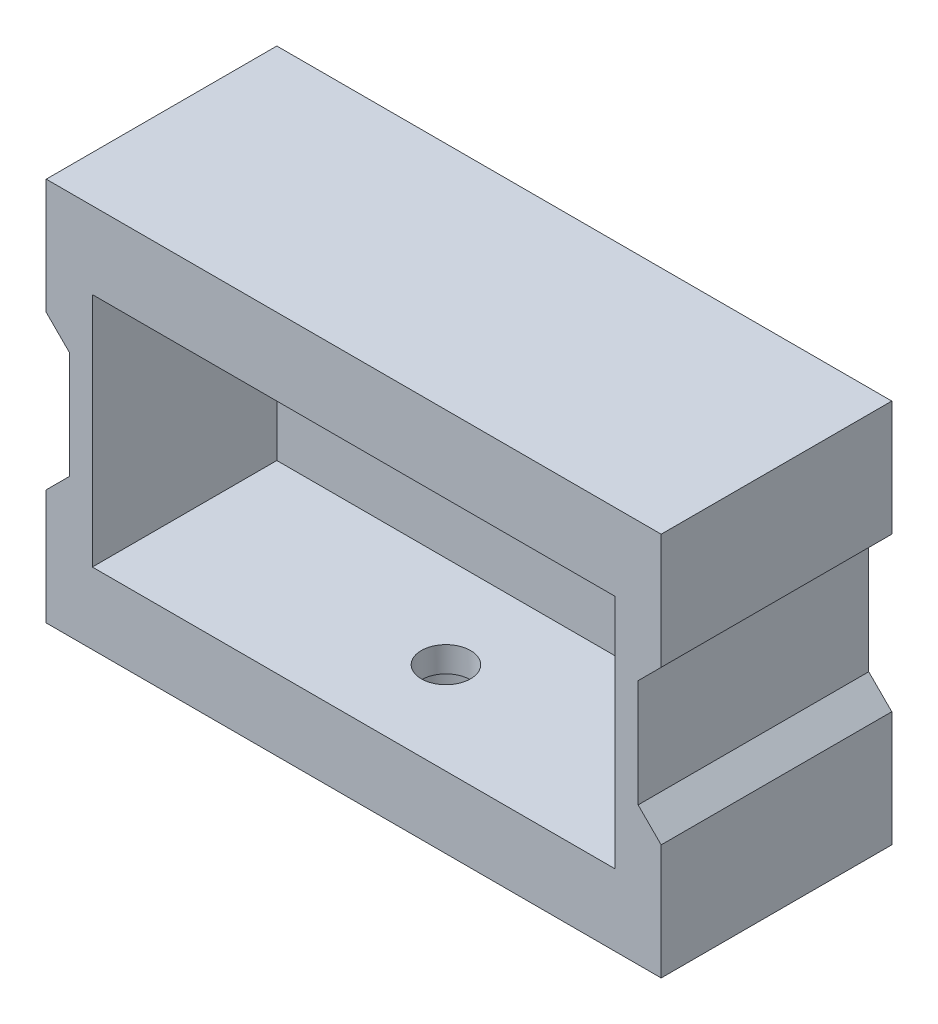
ISO-10303-21;
HEADER;
FILE_DESCRIPTION(('STEP AP214'),'2;1');
FILE_NAME('part.step','',(''),(''),'','','');
FILE_SCHEMA(('AUTOMOTIVE_DESIGN { 1 0 10303 214 1 1 1 1 }'));
ENDSEC;
DATA;
#1=APPLICATION_CONTEXT('core data for automotive mechanical design processes');
#2=APPLICATION_PROTOCOL_DEFINITION('international standard','automotive_design',2000,#1);
#3=PRODUCT_CONTEXT('',#1,'mechanical');
#4=PRODUCT('Part','Part','',(#3));
#5=PRODUCT_RELATED_PRODUCT_CATEGORY('part','',(#4));
#6=PRODUCT_DEFINITION_FORMATION('','',#4);
#7=PRODUCT_DEFINITION_CONTEXT('part definition',#1,'design');
#8=PRODUCT_DEFINITION('design','',#6,#7);
#9=PRODUCT_DEFINITION_SHAPE('','',#8);
#10=(LENGTH_UNIT() NAMED_UNIT(*) SI_UNIT(.MILLI.,.METRE.));
#11=(NAMED_UNIT(*) PLANE_ANGLE_UNIT() SI_UNIT($,.RADIAN.));
#12=(NAMED_UNIT(*) SI_UNIT($,.STERADIAN.) SOLID_ANGLE_UNIT());
#13=UNCERTAINTY_MEASURE_WITH_UNIT(LENGTH_MEASURE(1.E-05),#10,'distance_accuracy_value','');
#14=(GEOMETRIC_REPRESENTATION_CONTEXT(3) GLOBAL_UNCERTAINTY_ASSIGNED_CONTEXT((#13)) GLOBAL_UNIT_ASSIGNED_CONTEXT((#10,
#11,#12)) REPRESENTATION_CONTEXT('',''));
#15=CARTESIAN_POINT('',(0.,0.,0.));
#16=DIRECTION('',(0.,0.,1.));
#17=DIRECTION('',(1.,0.,0.));
#18=AXIS2_PLACEMENT_3D('',#15,#16,#17);
#19=CARTESIAN_POINT('',(0.,0.,6.));
#20=DIRECTION('',(0.,0.,1.));
#21=DIRECTION('',(1.,0.,0.));
#22=AXIS2_PLACEMENT_3D('',#19,#20,#21);
#23=PLANE('',#22);
#24=DIRECTION('',(-1.,0.,0.));
#25=VECTOR('',#24,1.);
#26=CARTESIAN_POINT('',(0.,-2.99999999999999,6.));
#27=LINE('',#26,#25);
#28=CARTESIAN_POINT('',(28.7320508075689,-3.,6.));
#29=VERTEX_POINT('',#28);
#30=CARTESIAN_POINT('',(25.2679491924311,-3.,6.));
#31=VERTEX_POINT('',#30);
#32=EDGE_CURVE('E347',#29,#31,#27,.T.);
#33=ORIENTED_EDGE('',*,*,#32,.T.);
#34=DIRECTION('',(-0.5,0.866025403784439,0.));
#35=VECTOR('',#34,1.);
#36=CARTESIAN_POINT('',(17.6519237886467,10.1913429510899,6.));
#37=LINE('',#36,#35);
#38=CARTESIAN_POINT('',(23.5358983848622,0.,6.));
#39=VERTEX_POINT('',#38);
#40=EDGE_CURVE('E70',#31,#39,#37,.T.);
#41=ORIENTED_EDGE('',*,*,#40,.T.);
#42=DIRECTION('',(0.5,0.866025403784439,0.));
#43=VECTOR('',#42,1.);
#44=CARTESIAN_POINT('',(17.6519237886467,-10.1913429510899,6.));
#45=LINE('',#44,#43);
#46=CARTESIAN_POINT('',(25.2679491924311,3.00000000000001,6.));
#47=VERTEX_POINT('',#46);
#48=EDGE_CURVE('E365',#39,#47,#45,.T.);
#49=ORIENTED_EDGE('',*,*,#48,.T.);
#50=DIRECTION('',(1.,0.,0.));
#51=VECTOR('',#50,1.);
#52=CARTESIAN_POINT('',(0.,3.00000000000001,6.));
#53=LINE('',#52,#51);
#54=CARTESIAN_POINT('',(28.7320508075689,3.00000000000001,6.));
#55=VERTEX_POINT('',#54);
#56=EDGE_CURVE('E369',#47,#55,#53,.T.);
#57=ORIENTED_EDGE('',*,*,#56,.T.);
#58=DIRECTION('',(0.5,-0.866025403784439,0.));
#59=VECTOR('',#58,1.);
#60=CARTESIAN_POINT('',(22.8480762113533,13.1913429510899,6.));
#61=LINE('',#60,#59);
#62=CARTESIAN_POINT('',(30.4641016151377,0.,6.));
#63=VERTEX_POINT('',#62);
#64=EDGE_CURVE('E373',#55,#63,#61,.T.);
#65=ORIENTED_EDGE('',*,*,#64,.T.);
#66=DIRECTION('',(-0.5,-0.866025403784439,0.));
#67=VECTOR('',#66,1.);
#68=CARTESIAN_POINT('',(22.8480762113533,-13.1913429510899,6.));
#69=LINE('',#68,#67);
#70=EDGE_CURVE('E377',#63,#29,#69,.T.);
#71=ORIENTED_EDGE('',*,*,#70,.T.);
#72=EDGE_LOOP('',(#33,#41,#49,#57,#65,#71));
#73=FACE_BOUND('',#72,.T.);
#74=DIRECTION('',(0.,-1.,0.));
#75=VECTOR('',#74,1.);
#76=CARTESIAN_POINT('',(-34.,0.,6.));
#77=LINE('',#76,#75);
#78=CARTESIAN_POINT('',(-34.,15.,6.));
#79=VERTEX_POINT('',#78);
#80=CARTESIAN_POINT('',(-34.,-15.7,6.00000000000001));
#81=VERTEX_POINT('',#80);
#82=EDGE_CURVE('E416',#79,#81,#77,.T.);
#83=ORIENTED_EDGE('',*,*,#82,.T.);
#84=DIRECTION('',(-1.,0.,0.));
#85=VECTOR('',#84,1.);
#86=CARTESIAN_POINT('',(0.,-15.7,6.00000000000001));
#87=LINE('',#86,#85);
#88=CARTESIAN_POINT('',(34.,-15.7,6.00000000000001));
#89=VERTEX_POINT('',#88);
#90=EDGE_CURVE('E257',#89,#81,#87,.T.);
#91=ORIENTED_EDGE('',*,*,#90,.F.);
#92=DIRECTION('',(0.,1.,0.));
#93=VECTOR('',#92,1.);
#94=CARTESIAN_POINT('',(34.,0.,6.));
#95=LINE('',#94,#93);
#96=CARTESIAN_POINT('',(34.,15.,6.));
#97=VERTEX_POINT('',#96);
#98=EDGE_CURVE('E246',#89,#97,#95,.T.);
#99=ORIENTED_EDGE('',*,*,#98,.T.);
#100=DIRECTION('',(-1.,0.,0.));
#101=VECTOR('',#100,1.);
#102=CARTESIAN_POINT('',(0.,15.,6.));
#103=LINE('',#102,#101);
#104=EDGE_CURVE('E412',#97,#79,#103,.T.);
#105=ORIENTED_EDGE('',*,*,#104,.T.);
#106=EDGE_LOOP('',(#83,#91,#99,#105));
#107=FACE_BOUND('',#106,.T.);
#108=DIRECTION('',(-1.,0.,0.));
#109=VECTOR('',#108,1.);
#110=CARTESIAN_POINT('',(0.,-3.,6.));
#111=LINE('',#110,#109);
#112=CARTESIAN_POINT('',(-25.2679491924311,-3.,6.));
#113=VERTEX_POINT('',#112);
#114=CARTESIAN_POINT('',(-28.7320508075689,-3.,6.));
#115=VERTEX_POINT('',#114);
#116=EDGE_CURVE('E286',#113,#115,#111,.T.);
#117=ORIENTED_EDGE('',*,*,#116,.T.);
#118=DIRECTION('',(-0.500000000000001,0.866025403784438,0.));
#119=VECTOR('',#118,1.);
#120=CARTESIAN_POINT('',(-22.8480762113533,-13.1913429510899,6.));
#121=LINE('',#120,#119);
#122=CARTESIAN_POINT('',(-30.4641016151378,0.,6.));
#123=VERTEX_POINT('',#122);
#124=EDGE_CURVE('E62',#115,#123,#121,.T.);
#125=ORIENTED_EDGE('',*,*,#124,.T.);
#126=DIRECTION('',(0.5,0.866025403784439,0.));
#127=VECTOR('',#126,1.);
#128=CARTESIAN_POINT('',(-22.8480762113533,13.1913429510899,6.));
#129=LINE('',#128,#127);
#130=CARTESIAN_POINT('',(-28.7320508075689,3.,6.));
#131=VERTEX_POINT('',#130);
#132=EDGE_CURVE('E304',#123,#131,#129,.T.);
#133=ORIENTED_EDGE('',*,*,#132,.T.);
#134=DIRECTION('',(1.,0.,0.));
#135=VECTOR('',#134,1.);
#136=CARTESIAN_POINT('',(0.,3.,6.));
#137=LINE('',#136,#135);
#138=CARTESIAN_POINT('',(-25.2679491924311,3.00000000000001,6.));
#139=VERTEX_POINT('',#138);
#140=EDGE_CURVE('E309',#131,#139,#137,.T.);
#141=ORIENTED_EDGE('',*,*,#140,.T.);
#142=DIRECTION('',(0.5,-0.866025403784439,0.));
#143=VECTOR('',#142,1.);
#144=CARTESIAN_POINT('',(-17.6519237886467,-10.1913429510899,6.));
#145=LINE('',#144,#143);
#146=CARTESIAN_POINT('',(-23.5358983848623,0.,6.));
#147=VERTEX_POINT('',#146);
#148=EDGE_CURVE('E313',#139,#147,#145,.T.);
#149=ORIENTED_EDGE('',*,*,#148,.T.);
#150=DIRECTION('',(-0.499999999999999,-0.866025403784439,0.));
#151=VECTOR('',#150,1.);
#152=CARTESIAN_POINT('',(-17.6519237886467,10.1913429510899,6.));
#153=LINE('',#152,#151);
#154=EDGE_CURVE('E317',#147,#113,#153,.T.);
#155=ORIENTED_EDGE('',*,*,#154,.T.);
#156=EDGE_LOOP('',(#117,#125,#133,#141,#149,#155));
#157=FACE_BOUND('',#156,.T.);
#158=ADVANCED_FACE('F43',(#73,#107,#157),#23,.T.);
#159=CARTESIAN_POINT('',(40.,-25.,30.));
#160=DIRECTION('',(-1.,0.,0.));
#161=DIRECTION('',(0.,0.,1.));
#162=AXIS2_PLACEMENT_3D('',#159,#160,#161);
#163=PLANE('',#162);
#164=DIRECTION('',(0.,0.,-1.));
#165=VECTOR('',#164,1.);
#166=CARTESIAN_POINT('',(40.,-10.,30.));
#167=LINE('',#166,#165);
#168=CARTESIAN_POINT('',(40.,-10.,30.));
#169=VERTEX_POINT('',#168);
#170=CARTESIAN_POINT('',(40.,-10.,0.));
#171=VERTEX_POINT('',#170);
#172=EDGE_CURVE('E440',#169,#171,#167,.T.);
#173=ORIENTED_EDGE('',*,*,#172,.F.);
#174=DIRECTION('',(0.,1.,0.));
#175=VECTOR('',#174,1.);
#176=CARTESIAN_POINT('',(40.,-25.,30.));
#177=LINE('',#176,#175);
#178=CARTESIAN_POINT('',(40.,-25.,30.));
#179=VERTEX_POINT('',#178);
#180=EDGE_CURVE('E453',#179,#169,#177,.T.);
#181=ORIENTED_EDGE('',*,*,#180,.F.);
#182=DIRECTION('',(0.,0.,-1.));
#183=VECTOR('',#182,1.);
#184=CARTESIAN_POINT('',(40.,-25.,30.));
#185=LINE('',#184,#183);
#186=CARTESIAN_POINT('',(40.,-25.,0.));
#187=VERTEX_POINT('',#186);
#188=EDGE_CURVE('E469',#179,#187,#185,.T.);
#189=ORIENTED_EDGE('',*,*,#188,.T.);
#190=DIRECTION('',(0.,1.,0.));
#191=VECTOR('',#190,1.);
#192=CARTESIAN_POINT('',(40.,-25.,0.));
#193=LINE('',#192,#191);
#194=EDGE_CURVE('E470',#187,#171,#193,.T.);
#195=ORIENTED_EDGE('',*,*,#194,.T.);
#196=EDGE_LOOP('',(#173,#181,#189,#195));
#197=FACE_BOUND('',#196,.T.);
#198=ADVANCED_FACE('F571',(#197),#163,.F.);
#199=DIRECTION('',(0.,0.,1.));
#200=VECTOR('',#199,1.);
#201=CARTESIAN_POINT('',(40.,10.,30.));
#202=LINE('',#201,#200);
#203=CARTESIAN_POINT('',(40.,10.,0.));
#204=VERTEX_POINT('',#203);
#205=CARTESIAN_POINT('',(40.,10.,30.));
#206=VERTEX_POINT('',#205);
#207=EDGE_CURVE('E433',#204,#206,#202,.T.);
#208=ORIENTED_EDGE('',*,*,#207,.F.);
#209=CARTESIAN_POINT('',(40.,25.,0.));
#210=VERTEX_POINT('',#209);
#211=EDGE_CURVE('E452',#204,#210,#193,.T.);
#212=ORIENTED_EDGE('',*,*,#211,.T.);
#213=DIRECTION('',(0.,0.,-1.));
#214=VECTOR('',#213,1.);
#215=CARTESIAN_POINT('',(40.,25.,30.));
#216=LINE('',#215,#214);
#217=CARTESIAN_POINT('',(40.,25.,30.));
#218=VERTEX_POINT('',#217);
#219=EDGE_CURVE('E496',#218,#210,#216,.T.);
#220=ORIENTED_EDGE('',*,*,#219,.F.);
#221=EDGE_CURVE('E458',#206,#218,#177,.T.);
#222=ORIENTED_EDGE('',*,*,#221,.F.);
#223=EDGE_LOOP('',(#208,#212,#220,#222));
#224=FACE_BOUND('',#223,.T.);
#225=ADVANCED_FACE('F577',(#224),#163,.F.);
#226=CARTESIAN_POINT('',(-40.,-25.,30.));
#227=DIRECTION('',(1.,0.,0.));
#228=DIRECTION('',(0.,0.,-1.));
#229=AXIS2_PLACEMENT_3D('',#226,#227,#228);
#230=PLANE('',#229);
#231=DIRECTION('',(0.,0.,-1.));
#232=VECTOR('',#231,1.);
#233=CARTESIAN_POINT('',(-40.,10.,30.));
#234=LINE('',#233,#232);
#235=CARTESIAN_POINT('',(-40.,10.,30.));
#236=VERTEX_POINT('',#235);
#237=CARTESIAN_POINT('',(-40.,10.,0.));
#238=VERTEX_POINT('',#237);
#239=EDGE_CURVE('E448',#236,#238,#234,.T.);
#240=ORIENTED_EDGE('',*,*,#239,.F.);
#241=DIRECTION('',(0.,-1.,0.));
#242=VECTOR('',#241,1.);
#243=CARTESIAN_POINT('',(-40.,-25.,30.));
#244=LINE('',#243,#242);
#245=CARTESIAN_POINT('',(-40.,25.,30.));
#246=VERTEX_POINT('',#245);
#247=EDGE_CURVE('E462',#246,#236,#244,.T.);
#248=ORIENTED_EDGE('',*,*,#247,.F.);
#249=DIRECTION('',(0.,0.,-1.));
#250=VECTOR('',#249,1.);
#251=CARTESIAN_POINT('',(-40.,25.,30.));
#252=LINE('',#251,#250);
#253=CARTESIAN_POINT('',(-40.,25.,0.));
#254=VERTEX_POINT('',#253);
#255=EDGE_CURVE('E492',#246,#254,#252,.T.);
#256=ORIENTED_EDGE('',*,*,#255,.T.);
#257=DIRECTION('',(0.,-1.,0.));
#258=VECTOR('',#257,1.);
#259=CARTESIAN_POINT('',(-40.,-25.,0.));
#260=LINE('',#259,#258);
#261=EDGE_CURVE('E478',#254,#238,#260,.T.);
#262=ORIENTED_EDGE('',*,*,#261,.T.);
#263=EDGE_LOOP('',(#240,#248,#256,#262));
#264=FACE_BOUND('',#263,.T.);
#265=ADVANCED_FACE('F615',(#264),#230,.F.);
#266=DIRECTION('',(0.,0.,1.));
#267=VECTOR('',#266,1.);
#268=CARTESIAN_POINT('',(-40.,-10.,30.));
#269=LINE('',#268,#267);
#270=CARTESIAN_POINT('',(-40.,-10.,0.));
#271=VERTEX_POINT('',#270);
#272=CARTESIAN_POINT('',(-40.,-10.,30.));
#273=VERTEX_POINT('',#272);
#274=EDGE_CURVE('E444',#271,#273,#269,.T.);
#275=ORIENTED_EDGE('',*,*,#274,.F.);
#276=CARTESIAN_POINT('',(-40.,-25.,0.));
#277=VERTEX_POINT('',#276);
#278=EDGE_CURVE('E477',#271,#277,#260,.T.);
#279=ORIENTED_EDGE('',*,*,#278,.T.);
#280=DIRECTION('',(0.,0.,-1.));
#281=VECTOR('',#280,1.);
#282=CARTESIAN_POINT('',(-40.,-25.,30.));
#283=LINE('',#282,#281);
#284=CARTESIAN_POINT('',(-40.,-25.,30.));
#285=VERTEX_POINT('',#284);
#286=EDGE_CURVE('E488',#285,#277,#283,.T.);
#287=ORIENTED_EDGE('',*,*,#286,.F.);
#288=EDGE_CURVE('E461',#273,#285,#244,.T.);
#289=ORIENTED_EDGE('',*,*,#288,.F.);
#290=EDGE_LOOP('',(#275,#279,#287,#289));
#291=FACE_BOUND('',#290,.T.);
#292=ADVANCED_FACE('F607',(#291),#230,.F.);
#293=CARTESIAN_POINT('',(0.,0.,30.));
#294=DIRECTION('',(0.,0.,-1.));
#295=DIRECTION('',(-1.,0.,0.));
#296=AXIS2_PLACEMENT_3D('',#293,#294,#295);
#297=PLANE('',#296);
#298=DIRECTION('',(0.,1.,0.));
#299=VECTOR('',#298,1.);
#300=CARTESIAN_POINT('',(34.,0.,30.));
#301=LINE('',#300,#299);
#302=CARTESIAN_POINT('',(34.,-15.7,30.));
#303=VERTEX_POINT('',#302);
#304=CARTESIAN_POINT('',(34.,15.,30.));
#305=VERTEX_POINT('',#304);
#306=EDGE_CURVE('E264',#303,#305,#301,.T.);
#307=ORIENTED_EDGE('',*,*,#306,.F.);
#308=DIRECTION('',(1.,0.,0.));
#309=VECTOR('',#308,1.);
#310=CARTESIAN_POINT('',(0.,-15.7,30.));
#311=LINE('',#310,#309);
#312=CARTESIAN_POINT('',(-34.,-15.7,30.));
#313=VERTEX_POINT('',#312);
#314=EDGE_CURVE('E255',#313,#303,#311,.T.);
#315=ORIENTED_EDGE('',*,*,#314,.F.);
#316=DIRECTION('',(0.,-1.,0.));
#317=VECTOR('',#316,1.);
#318=CARTESIAN_POINT('',(-34.,0.,30.));
#319=LINE('',#318,#317);
#320=CARTESIAN_POINT('',(-34.,15.,30.));
#321=VERTEX_POINT('',#320);
#322=EDGE_CURVE('E235',#321,#313,#319,.T.);
#323=ORIENTED_EDGE('',*,*,#322,.F.);
#324=DIRECTION('',(-1.,0.,0.));
#325=VECTOR('',#324,1.);
#326=CARTESIAN_POINT('',(0.,15.,30.));
#327=LINE('',#326,#325);
#328=EDGE_CURVE('E247',#305,#321,#327,.T.);
#329=ORIENTED_EDGE('',*,*,#328,.F.);
#330=EDGE_LOOP('',(#307,#315,#323,#329));
#331=FACE_BOUND('',#330,.T.);
#332=ORIENTED_EDGE('',*,*,#247,.T.);
#333=DIRECTION('',(-0.707106781186543,0.707106781186552,0.));
#334=VECTOR('',#333,1.);
#335=CARTESIAN_POINT('',(-15.0000000000002,-15.,30.));
#336=LINE('',#335,#334);
#337=CARTESIAN_POINT('',(-37.,7.,30.));
#338=VERTEX_POINT('',#337);
#339=EDGE_CURVE('E11',#236,#338,#336,.F.);
#340=ORIENTED_EDGE('',*,*,#339,.T.);
#341=DIRECTION('',(0.,1.,0.));
#342=VECTOR('',#341,1.);
#343=CARTESIAN_POINT('',(-37.,-10.,30.));
#344=LINE('',#343,#342);
#345=CARTESIAN_POINT('',(-37.,-7.00000000000002,30.));
#346=VERTEX_POINT('',#345);
#347=EDGE_CURVE('E429',#346,#338,#344,.T.);
#348=ORIENTED_EDGE('',*,*,#347,.F.);
#349=DIRECTION('',(0.707106781186551,0.707106781186544,0.));
#350=VECTOR('',#349,1.);
#351=CARTESIAN_POINT('',(-14.9999999999998,15.,30.));
#352=LINE('',#351,#350);
#353=EDGE_CURVE('E537',#346,#273,#352,.F.);
#354=ORIENTED_EDGE('',*,*,#353,.T.);
#355=ORIENTED_EDGE('',*,*,#288,.T.);
#356=DIRECTION('',(1.,0.,0.));
#357=VECTOR('',#356,1.);
#358=CARTESIAN_POINT('',(-40.,-25.,30.));
#359=LINE('',#358,#357);
#360=EDGE_CURVE('E466',#285,#179,#359,.T.);
#361=ORIENTED_EDGE('',*,*,#360,.T.);
#362=ORIENTED_EDGE('',*,*,#180,.T.);
#363=DIRECTION('',(0.707106781186543,-0.707106781186552,0.));
#364=VECTOR('',#363,1.);
#365=CARTESIAN_POINT('',(15.0000000000003,15.,30.));
#366=LINE('',#365,#364);
#367=CARTESIAN_POINT('',(37.,-6.99999999999998,30.));
#368=VERTEX_POINT('',#367);
#369=EDGE_CURVE('E531',#169,#368,#366,.F.);
#370=ORIENTED_EDGE('',*,*,#369,.T.);
#371=DIRECTION('',(0.,-1.,0.));
#372=VECTOR('',#371,1.);
#373=CARTESIAN_POINT('',(37.,-10.,30.));
#374=LINE('',#373,#372);
#375=CARTESIAN_POINT('',(37.,7.00000000000002,30.));
#376=VERTEX_POINT('',#375);
#377=EDGE_CURVE('E426',#376,#368,#374,.T.);
#378=ORIENTED_EDGE('',*,*,#377,.F.);
#379=DIRECTION('',(-0.707106781186551,-0.707106781186544,0.));
#380=VECTOR('',#379,1.);
#381=CARTESIAN_POINT('',(14.9999999999998,-14.9999999999999,30.));
#382=LINE('',#381,#380);
#383=EDGE_CURVE('E525',#376,#206,#382,.F.);
#384=ORIENTED_EDGE('',*,*,#383,.T.);
#385=ORIENTED_EDGE('',*,*,#221,.T.);
#386=DIRECTION('',(-1.,0.,0.));
#387=VECTOR('',#386,1.);
#388=CARTESIAN_POINT('',(-40.,25.,30.));
#389=LINE('',#388,#387);
#390=EDGE_CURVE('E457',#218,#246,#389,.T.);
#391=ORIENTED_EDGE('',*,*,#390,.T.);
#392=EDGE_LOOP('',(#332,#340,#348,#354,#355,#361,#362,#370,#378,#384,#385,#391));
#393=FACE_BOUND('',#392,.T.);
#394=ADVANCED_FACE('F261',(#331,#393),#297,.F.);
#395=CARTESIAN_POINT('',(0.,0.,0.));
#396=DIRECTION('',(0.,0.,-1.));
#397=DIRECTION('',(-1.,0.,0.));
#398=AXIS2_PLACEMENT_3D('',#395,#396,#397);
#399=PLANE('',#398);
#400=CARTESIAN_POINT('',(27.,0.,0.));
#401=DIRECTION('',(0.,0.,-1.));
#402=DIRECTION('',(-1.,0.,0.));
#403=AXIS2_PLACEMENT_3D('',#400,#401,#402);
#404=CIRCLE('',#403,1.75);
#405=CARTESIAN_POINT('',(25.25,0.,0.));
#406=VERTEX_POINT('',#405);
#407=EDGE_CURVE('E404',#406,#406,#404,.F.);
#408=ORIENTED_EDGE('',*,*,#407,.T.);
#409=EDGE_LOOP('',(#408));
#410=FACE_BOUND('',#409,.T.);
#411=CARTESIAN_POINT('',(-27.,0.,0.));
#412=DIRECTION('',(0.,0.,-1.));
#413=DIRECTION('',(-1.,0.,0.));
#414=AXIS2_PLACEMENT_3D('',#411,#412,#413);
#415=CIRCLE('',#414,1.75);
#416=CARTESIAN_POINT('',(-28.75,0.,0.));
#417=VERTEX_POINT('',#416);
#418=EDGE_CURVE('E400',#417,#417,#415,.F.);
#419=ORIENTED_EDGE('',*,*,#418,.T.);
#420=EDGE_LOOP('',(#419));
#421=FACE_BOUND('',#420,.T.);
#422=ORIENTED_EDGE('',*,*,#278,.F.);
#423=DIRECTION('',(-0.707106781186551,-0.707106781186544,0.));
#424=VECTOR('',#423,1.);
#425=CARTESIAN_POINT('',(-40.,-10.,0.));
#426=LINE('',#425,#424);
#427=CARTESIAN_POINT('',(-37.,-7.00000000000002,0.));
#428=VERTEX_POINT('',#427);
#429=EDGE_CURVE('E534',#271,#428,#426,.F.);
#430=ORIENTED_EDGE('',*,*,#429,.T.);
#431=DIRECTION('',(0.,1.,0.));
#432=VECTOR('',#431,1.);
#433=CARTESIAN_POINT('',(-37.,0.,0.));
#434=LINE('',#433,#432);
#435=CARTESIAN_POINT('',(-37.,7.,0.));
#436=VERTEX_POINT('',#435);
#437=EDGE_CURVE('E504',#428,#436,#434,.T.);
#438=ORIENTED_EDGE('',*,*,#437,.T.);
#439=DIRECTION('',(0.707106781186543,-0.707106781186552,0.));
#440=VECTOR('',#439,1.);
#441=CARTESIAN_POINT('',(-37.,7.,0.));
#442=LINE('',#441,#440);
#443=EDGE_CURVE('E54',#436,#238,#442,.F.);
#444=ORIENTED_EDGE('',*,*,#443,.T.);
#445=ORIENTED_EDGE('',*,*,#261,.F.);
#446=DIRECTION('',(-1.,0.,0.));
#447=VECTOR('',#446,1.);
#448=CARTESIAN_POINT('',(-40.,25.,0.));
#449=LINE('',#448,#447);
#450=EDGE_CURVE('E474',#210,#254,#449,.T.);
#451=ORIENTED_EDGE('',*,*,#450,.F.);
#452=ORIENTED_EDGE('',*,*,#211,.F.);
#453=DIRECTION('',(0.707106781186551,0.707106781186544,0.));
#454=VECTOR('',#453,1.);
#455=CARTESIAN_POINT('',(40.,10.,0.));
#456=LINE('',#455,#454);
#457=CARTESIAN_POINT('',(37.,7.00000000000002,0.));
#458=VERTEX_POINT('',#457);
#459=EDGE_CURVE('E522',#204,#458,#456,.F.);
#460=ORIENTED_EDGE('',*,*,#459,.T.);
#461=DIRECTION('',(0.,-1.,0.));
#462=VECTOR('',#461,1.);
#463=CARTESIAN_POINT('',(37.,0.,0.));
#464=LINE('',#463,#462);
#465=CARTESIAN_POINT('',(37.,-6.99999999999998,0.));
#466=VERTEX_POINT('',#465);
#467=EDGE_CURVE('E500',#458,#466,#464,.T.);
#468=ORIENTED_EDGE('',*,*,#467,.T.);
#469=DIRECTION('',(-0.707106781186543,0.707106781186552,0.));
#470=VECTOR('',#469,1.);
#471=CARTESIAN_POINT('',(37.,-6.99999999999998,0.));
#472=LINE('',#471,#470);
#473=EDGE_CURVE('E528',#466,#171,#472,.F.);
#474=ORIENTED_EDGE('',*,*,#473,.T.);
#475=ORIENTED_EDGE('',*,*,#194,.F.);
#476=DIRECTION('',(1.,0.,0.));
#477=VECTOR('',#476,1.);
#478=CARTESIAN_POINT('',(-40.,-25.,0.));
#479=LINE('',#478,#477);
#480=EDGE_CURVE('E482',#277,#187,#479,.T.);
#481=ORIENTED_EDGE('',*,*,#480,.F.);
#482=EDGE_LOOP('',(#422,#430,#438,#444,#445,#451,#452,#460,#468,#474,#475,#481));
#483=FACE_BOUND('',#482,.T.);
#484=ADVANCED_FACE('F606',(#410,#421,#483),#399,.T.);
#485=CARTESIAN_POINT('',(-40.,25.,30.));
#486=DIRECTION('',(0.,-1.,0.));
#487=DIRECTION('',(0.,0.,-1.));
#488=AXIS2_PLACEMENT_3D('',#485,#486,#487);
#489=PLANE('',#488);
#490=ORIENTED_EDGE('',*,*,#450,.T.);
#491=ORIENTED_EDGE('',*,*,#255,.F.);
#492=ORIENTED_EDGE('',*,*,#390,.F.);
#493=ORIENTED_EDGE('',*,*,#219,.T.);
#494=EDGE_LOOP('',(#490,#491,#492,#493));
#495=FACE_BOUND('',#494,.T.);
#496=ADVANCED_FACE('F610',(#495),#489,.F.);
#497=CARTESIAN_POINT('',(-40.,-25.,30.));
#498=DIRECTION('',(0.,1.,0.));
#499=DIRECTION('',(0.,0.,1.));
#500=AXIS2_PLACEMENT_3D('',#497,#498,#499);
#501=PLANE('',#500);
#502=CARTESIAN_POINT('',(0.,-25.,18.));
#503=DIRECTION('',(0.,1.,0.));
#504=DIRECTION('',(0.,0.,1.));
#505=AXIS2_PLACEMENT_3D('',#502,#503,#504);
#506=CIRCLE('',#505,5.25);
#507=CARTESIAN_POINT('',(0.,-25.,23.25));
#508=VERTEX_POINT('',#507);
#509=EDGE_CURVE('E277',#508,#508,#506,.T.);
#510=ORIENTED_EDGE('',*,*,#509,.T.);
#511=EDGE_LOOP('',(#510));
#512=FACE_BOUND('',#511,.T.);
#513=ORIENTED_EDGE('',*,*,#480,.T.);
#514=ORIENTED_EDGE('',*,*,#188,.F.);
#515=ORIENTED_EDGE('',*,*,#360,.F.);
#516=ORIENTED_EDGE('',*,*,#286,.T.);
#517=EDGE_LOOP('',(#513,#514,#515,#516));
#518=FACE_BOUND('',#517,.T.);
#519=ADVANCED_FACE('F602',(#512,#518),#501,.F.);
#520=CARTESIAN_POINT('',(37.,-10.,30.));
#521=DIRECTION('',(1.,0.,0.));
#522=DIRECTION('',(0.,0.,-1.));
#523=AXIS2_PLACEMENT_3D('',#520,#521,#522);
#524=PLANE('',#523);
#525=ORIENTED_EDGE('',*,*,#467,.F.);
#526=DIRECTION('',(0.,0.,1.));
#527=VECTOR('',#526,1.);
#528=CARTESIAN_POINT('',(37.,7.00000000000002,30.));
#529=LINE('',#528,#527);
#530=EDGE_CURVE('E512',#458,#376,#529,.T.);
#531=ORIENTED_EDGE('',*,*,#530,.T.);
#532=ORIENTED_EDGE('',*,*,#377,.T.);
#533=DIRECTION('',(0.,0.,-1.));
#534=VECTOR('',#533,1.);
#535=CARTESIAN_POINT('',(37.,-6.99999999999998,0.));
#536=LINE('',#535,#534);
#537=EDGE_CURVE('E508',#368,#466,#536,.T.);
#538=ORIENTED_EDGE('',*,*,#537,.T.);
#539=EDGE_LOOP('',(#525,#531,#532,#538));
#540=FACE_BOUND('',#539,.T.);
#541=ADVANCED_FACE('F598',(#540),#524,.T.);
#542=CARTESIAN_POINT('',(-37.,-10.,30.));
#543=DIRECTION('',(-1.,0.,0.));
#544=DIRECTION('',(0.,0.,1.));
#545=AXIS2_PLACEMENT_3D('',#542,#543,#544);
#546=PLANE('',#545);
#547=ORIENTED_EDGE('',*,*,#437,.F.);
#548=DIRECTION('',(0.,0.,1.));
#549=VECTOR('',#548,1.);
#550=CARTESIAN_POINT('',(-37.,-7.00000000000002,30.));
#551=LINE('',#550,#549);
#552=EDGE_CURVE('E519',#428,#346,#551,.T.);
#553=ORIENTED_EDGE('',*,*,#552,.T.);
#554=ORIENTED_EDGE('',*,*,#347,.T.);
#555=DIRECTION('',(0.,0.,-1.));
#556=VECTOR('',#555,1.);
#557=CARTESIAN_POINT('',(-37.,7.,0.));
#558=LINE('',#557,#556);
#559=EDGE_CURVE('E515',#338,#436,#558,.T.);
#560=ORIENTED_EDGE('',*,*,#559,.T.);
#561=EDGE_LOOP('',(#547,#553,#554,#560));
#562=FACE_BOUND('',#561,.T.);
#563=ADVANCED_FACE('F594',(#562),#546,.T.);
#564=CARTESIAN_POINT('',(40.,10.,30.));
#565=DIRECTION('',(0.707106781186544,-0.707106781186551,0.));
#566=DIRECTION('',(0.,0.,1.));
#567=AXIS2_PLACEMENT_3D('',#564,#565,#566);
#568=PLANE('',#567);
#569=ORIENTED_EDGE('',*,*,#383,.F.);
#570=ORIENTED_EDGE('',*,*,#530,.F.);
#571=ORIENTED_EDGE('',*,*,#459,.F.);
#572=ORIENTED_EDGE('',*,*,#207,.T.);
#573=EDGE_LOOP('',(#569,#570,#571,#572));
#574=FACE_BOUND('',#573,.T.);
#575=ADVANCED_FACE('F597',(#574),#568,.T.);
#576=CARTESIAN_POINT('',(37.,-6.99999999999998,30.));
#577=DIRECTION('',(0.707106781186552,0.707106781186543,0.));
#578=DIRECTION('',(0.,0.,1.));
#579=AXIS2_PLACEMENT_3D('',#576,#577,#578);
#580=PLANE('',#579);
#581=ORIENTED_EDGE('',*,*,#369,.F.);
#582=ORIENTED_EDGE('',*,*,#172,.T.);
#583=ORIENTED_EDGE('',*,*,#473,.F.);
#584=ORIENTED_EDGE('',*,*,#537,.F.);
#585=EDGE_LOOP('',(#581,#582,#583,#584));
#586=FACE_BOUND('',#585,.T.);
#587=ADVANCED_FACE('F628',(#586),#580,.T.);
#588=CARTESIAN_POINT('',(-40.,-10.,30.));
#589=DIRECTION('',(-0.707106781186544,0.707106781186551,0.));
#590=DIRECTION('',(0.,0.,1.));
#591=AXIS2_PLACEMENT_3D('',#588,#589,#590);
#592=PLANE('',#591);
#593=ORIENTED_EDGE('',*,*,#353,.F.);
#594=ORIENTED_EDGE('',*,*,#552,.F.);
#595=ORIENTED_EDGE('',*,*,#429,.F.);
#596=ORIENTED_EDGE('',*,*,#274,.T.);
#597=EDGE_LOOP('',(#593,#594,#595,#596));
#598=FACE_BOUND('',#597,.T.);
#599=ADVANCED_FACE('F634',(#598),#592,.T.);
#600=CARTESIAN_POINT('',(-37.,7.,30.));
#601=DIRECTION('',(-0.707106781186552,-0.707106781186543,0.));
#602=DIRECTION('',(0.,0.,1.));
#603=AXIS2_PLACEMENT_3D('',#600,#601,#602);
#604=PLANE('',#603);
#605=ORIENTED_EDGE('',*,*,#339,.F.);
#606=ORIENTED_EDGE('',*,*,#239,.T.);
#607=ORIENTED_EDGE('',*,*,#443,.F.);
#608=ORIENTED_EDGE('',*,*,#559,.F.);
#609=EDGE_LOOP('',(#605,#606,#607,#608));
#610=FACE_BOUND('',#609,.T.);
#611=ADVANCED_FACE('F46',(#610),#604,.T.);
#612=CARTESIAN_POINT('',(-34.,0.,6.));
#613=DIRECTION('',(-1.,0.,0.));
#614=DIRECTION('',(0.,0.,1.));
#615=AXIS2_PLACEMENT_3D('',#612,#613,#614);
#616=PLANE('',#615);
#617=ORIENTED_EDGE('',*,*,#322,.T.);
#618=DIRECTION('',(0.,0.,1.));
#619=VECTOR('',#618,1.);
#620=CARTESIAN_POINT('',(-34.,-15.7,-62.0036028457316));
#621=LINE('',#620,#619);
#622=EDGE_CURVE('E239',#81,#313,#621,.T.);
#623=ORIENTED_EDGE('',*,*,#622,.F.);
#624=ORIENTED_EDGE('',*,*,#82,.F.);
#625=DIRECTION('',(0.,0.,1.));
#626=VECTOR('',#625,1.);
#627=CARTESIAN_POINT('',(-34.,15.,6.));
#628=LINE('',#627,#626);
#629=EDGE_CURVE('E240',#79,#321,#628,.T.);
#630=ORIENTED_EDGE('',*,*,#629,.T.);
#631=EDGE_LOOP('',(#617,#623,#624,#630));
#632=FACE_BOUND('',#631,.T.);
#633=ADVANCED_FACE('F237',(#632),#616,.F.);
#634=CARTESIAN_POINT('',(0.,15.,6.));
#635=DIRECTION('',(0.,1.,0.));
#636=DIRECTION('',(0.,0.,1.));
#637=AXIS2_PLACEMENT_3D('',#634,#635,#636);
#638=PLANE('',#637);
#639=ORIENTED_EDGE('',*,*,#328,.T.);
#640=ORIENTED_EDGE('',*,*,#629,.F.);
#641=ORIENTED_EDGE('',*,*,#104,.F.);
#642=DIRECTION('',(0.,0.,1.));
#643=VECTOR('',#642,1.);
#644=CARTESIAN_POINT('',(34.,15.,6.));
#645=LINE('',#644,#643);
#646=EDGE_CURVE('E419',#97,#305,#645,.T.);
#647=ORIENTED_EDGE('',*,*,#646,.T.);
#648=EDGE_LOOP('',(#639,#640,#641,#647));
#649=FACE_BOUND('',#648,.T.);
#650=ADVANCED_FACE('F586',(#649),#638,.F.);
#651=CARTESIAN_POINT('',(34.,0.,6.));
#652=DIRECTION('',(1.,0.,0.));
#653=DIRECTION('',(0.,0.,-1.));
#654=AXIS2_PLACEMENT_3D('',#651,#652,#653);
#655=PLANE('',#654);
#656=ORIENTED_EDGE('',*,*,#306,.T.);
#657=ORIENTED_EDGE('',*,*,#646,.F.);
#658=ORIENTED_EDGE('',*,*,#98,.F.);
#659=DIRECTION('',(0.,0.,1.));
#660=VECTOR('',#659,1.);
#661=CARTESIAN_POINT('',(34.,-15.7,-62.0036028457316));
#662=LINE('',#661,#660);
#663=EDGE_CURVE('E259',#89,#303,#662,.T.);
#664=ORIENTED_EDGE('',*,*,#663,.T.);
#665=EDGE_LOOP('',(#656,#657,#658,#664));
#666=FACE_BOUND('',#665,.T.);
#667=ADVANCED_FACE('F589',(#666),#655,.F.);
#668=CARTESIAN_POINT('',(0.,-25.,18.));
#669=DIRECTION('',(0.,1.,0.));
#670=DIRECTION('',(0.,0.,1.));
#671=AXIS2_PLACEMENT_3D('',#668,#669,#670);
#672=CYLINDRICAL_SURFACE('',#671,3.2);
#673=CARTESIAN_POINT('',(0.,-15.7,18.));
#674=DIRECTION('',(0.,-1.,0.));
#675=DIRECTION('',(0.,0.,-1.));
#676=AXIS2_PLACEMENT_3D('',#673,#674,#675);
#677=CIRCLE('',#676,3.2);
#678=CARTESIAN_POINT('',(0.,-15.7,14.8));
#679=VERTEX_POINT('',#678);
#680=EDGE_CURVE('E48',#679,#679,#677,.F.);
#681=ORIENTED_EDGE('',*,*,#680,.T.);
#682=EDGE_LOOP('',(#681));
#683=FACE_BOUND('',#682,.T.);
#684=CARTESIAN_POINT('',(0.,-19.,18.));
#685=DIRECTION('',(0.,1.,0.));
#686=DIRECTION('',(0.,0.,1.));
#687=AXIS2_PLACEMENT_3D('',#684,#685,#686);
#688=CIRCLE('',#687,3.2);
#689=CARTESIAN_POINT('',(0.,-19.,21.2));
#690=VERTEX_POINT('',#689);
#691=EDGE_CURVE('E276',#690,#690,#688,.F.);
#692=ORIENTED_EDGE('',*,*,#691,.T.);
#693=EDGE_LOOP('',(#692));
#694=FACE_BOUND('',#693,.T.);
#695=ADVANCED_FACE('F551',(#683,#694),#672,.F.);
#696=CARTESIAN_POINT('',(-27.,0.,30.));
#697=DIRECTION('',(0.,0.,-1.));
#698=DIRECTION('',(-1.,0.,0.));
#699=AXIS2_PLACEMENT_3D('',#696,#697,#698);
#700=CYLINDRICAL_SURFACE('',#699,1.75);
#701=CARTESIAN_POINT('',(-27.,0.,3.));
#702=DIRECTION('',(0.,0.,-1.));
#703=DIRECTION('',(-1.,0.,0.));
#704=AXIS2_PLACEMENT_3D('',#701,#702,#703);
#705=CIRCLE('',#704,1.75);
#706=CARTESIAN_POINT('',(-28.75,0.,3.));
#707=VERTEX_POINT('',#706);
#708=EDGE_CURVE('E405',#707,#707,#705,.T.);
#709=ORIENTED_EDGE('',*,*,#708,.F.);
#710=EDGE_LOOP('',(#709));
#711=FACE_BOUND('',#710,.T.);
#712=ORIENTED_EDGE('',*,*,#418,.F.);
#713=EDGE_LOOP('',(#712));
#714=FACE_BOUND('',#713,.T.);
#715=ADVANCED_FACE('F762',(#711,#714),#700,.F.);
#716=CARTESIAN_POINT('',(27.,0.,30.));
#717=DIRECTION('',(0.,0.,-1.));
#718=DIRECTION('',(-1.,0.,0.));
#719=AXIS2_PLACEMENT_3D('',#716,#717,#718);
#720=CYLINDRICAL_SURFACE('',#719,1.75);
#721=CARTESIAN_POINT('',(27.,0.,3.));
#722=DIRECTION('',(0.,0.,-1.));
#723=DIRECTION('',(-1.,0.,0.));
#724=AXIS2_PLACEMENT_3D('',#721,#722,#723);
#725=CIRCLE('',#724,1.75);
#726=CARTESIAN_POINT('',(25.25,0.,3.));
#727=VERTEX_POINT('',#726);
#728=EDGE_CURVE('E341',#727,#727,#725,.T.);
#729=ORIENTED_EDGE('',*,*,#728,.F.);
#730=EDGE_LOOP('',(#729));
#731=FACE_BOUND('',#730,.T.);
#732=ORIENTED_EDGE('',*,*,#407,.F.);
#733=EDGE_LOOP('',(#732));
#734=FACE_BOUND('',#733,.T.);
#735=ADVANCED_FACE('F769',(#731,#734),#720,.F.);
#736=CARTESIAN_POINT('',(17.6519237886467,10.1913429510899,3.));
#737=DIRECTION('',(0.866025403784439,0.5,0.));
#738=DIRECTION('',(-0.5,0.866025403784439,0.));
#739=AXIS2_PLACEMENT_3D('',#736,#737,#738);
#740=PLANE('',#739);
#741=ORIENTED_EDGE('',*,*,#40,.F.);
#742=DIRECTION('',(0.,0.,1.));
#743=VECTOR('',#742,1.);
#744=CARTESIAN_POINT('',(25.2679491924311,-3.,3.));
#745=LINE('',#744,#743);
#746=CARTESIAN_POINT('',(25.2679491924311,-3.,3.));
#747=VERTEX_POINT('',#746);
#748=EDGE_CURVE('E362',#747,#31,#745,.T.);
#749=ORIENTED_EDGE('',*,*,#748,.F.);
#750=DIRECTION('',(-0.5,0.866025403784439,0.));
#751=VECTOR('',#750,1.);
#752=CARTESIAN_POINT('',(17.6519237886467,10.1913429510899,3.));
#753=LINE('',#752,#751);
#754=CARTESIAN_POINT('',(23.5358983848622,0.,3.));
#755=VERTEX_POINT('',#754);
#756=EDGE_CURVE('E342',#747,#755,#753,.T.);
#757=ORIENTED_EDGE('',*,*,#756,.T.);
#758=DIRECTION('',(0.,0.,1.));
#759=VECTOR('',#758,1.);
#760=CARTESIAN_POINT('',(23.5358983848622,0.,3.));
#761=LINE('',#760,#759);
#762=EDGE_CURVE('E305',#755,#39,#761,.T.);
#763=ORIENTED_EDGE('',*,*,#762,.T.);
#764=EDGE_LOOP('',(#741,#749,#757,#763));
#765=FACE_BOUND('',#764,.T.);
#766=ADVANCED_FACE('F776',(#765),#740,.T.);
#767=CARTESIAN_POINT('',(17.6519237886467,-10.1913429510899,3.));
#768=DIRECTION('',(0.866025403784439,-0.5,0.));
#769=DIRECTION('',(0.5,0.866025403784439,0.));
#770=AXIS2_PLACEMENT_3D('',#767,#768,#769);
#771=PLANE('',#770);
#772=ORIENTED_EDGE('',*,*,#48,.F.);
#773=ORIENTED_EDGE('',*,*,#762,.F.);
#774=DIRECTION('',(0.5,0.866025403784439,0.));
#775=VECTOR('',#774,1.);
#776=CARTESIAN_POINT('',(17.6519237886467,-10.1913429510899,3.));
#777=LINE('',#776,#775);
#778=CARTESIAN_POINT('',(25.2679491924311,3.00000000000001,3.));
#779=VERTEX_POINT('',#778);
#780=EDGE_CURVE('E346',#755,#779,#777,.T.);
#781=ORIENTED_EDGE('',*,*,#780,.T.);
#782=DIRECTION('',(0.,0.,1.));
#783=VECTOR('',#782,1.);
#784=CARTESIAN_POINT('',(25.2679491924311,3.00000000000001,3.));
#785=LINE('',#784,#783);
#786=EDGE_CURVE('E395',#779,#47,#785,.T.);
#787=ORIENTED_EDGE('',*,*,#786,.T.);
#788=EDGE_LOOP('',(#772,#773,#781,#787));
#789=FACE_BOUND('',#788,.T.);
#790=ADVANCED_FACE('F784',(#789),#771,.T.);
#791=CARTESIAN_POINT('',(0.,3.00000000000001,3.));
#792=DIRECTION('',(0.,-1.,0.));
#793=DIRECTION('',(1.,0.,0.));
#794=AXIS2_PLACEMENT_3D('',#791,#792,#793);
#795=PLANE('',#794);
#796=ORIENTED_EDGE('',*,*,#56,.F.);
#797=ORIENTED_EDGE('',*,*,#786,.F.);
#798=DIRECTION('',(1.,0.,0.));
#799=VECTOR('',#798,1.);
#800=CARTESIAN_POINT('',(0.,3.00000000000001,3.));
#801=LINE('',#800,#799);
#802=CARTESIAN_POINT('',(28.7320508075689,3.00000000000001,3.));
#803=VERTEX_POINT('',#802);
#804=EDGE_CURVE('E350',#779,#803,#801,.T.);
#805=ORIENTED_EDGE('',*,*,#804,.T.);
#806=DIRECTION('',(0.,0.,1.));
#807=VECTOR('',#806,1.);
#808=CARTESIAN_POINT('',(28.7320508075689,3.00000000000001,3.));
#809=LINE('',#808,#807);
#810=EDGE_CURVE('E392',#803,#55,#809,.T.);
#811=ORIENTED_EDGE('',*,*,#810,.T.);
#812=EDGE_LOOP('',(#796,#797,#805,#811));
#813=FACE_BOUND('',#812,.T.);
#814=ADVANCED_FACE('F791',(#813),#795,.T.);
#815=CARTESIAN_POINT('',(22.8480762113533,13.1913429510899,3.));
#816=DIRECTION('',(-0.866025403784439,-0.5,0.));
#817=DIRECTION('',(0.5,-0.866025403784439,0.));
#818=AXIS2_PLACEMENT_3D('',#815,#816,#817);
#819=PLANE('',#818);
#820=ORIENTED_EDGE('',*,*,#64,.F.);
#821=ORIENTED_EDGE('',*,*,#810,.F.);
#822=DIRECTION('',(0.5,-0.866025403784439,0.));
#823=VECTOR('',#822,1.);
#824=CARTESIAN_POINT('',(22.8480762113533,13.1913429510899,3.));
#825=LINE('',#824,#823);
#826=CARTESIAN_POINT('',(30.4641016151377,0.,3.));
#827=VERTEX_POINT('',#826);
#828=EDGE_CURVE('E353',#803,#827,#825,.T.);
#829=ORIENTED_EDGE('',*,*,#828,.T.);
#830=DIRECTION('',(0.,0.,1.));
#831=VECTOR('',#830,1.);
#832=CARTESIAN_POINT('',(30.4641016151377,0.,3.));
#833=LINE('',#832,#831);
#834=EDGE_CURVE('E389',#827,#63,#833,.T.);
#835=ORIENTED_EDGE('',*,*,#834,.T.);
#836=EDGE_LOOP('',(#820,#821,#829,#835));
#837=FACE_BOUND('',#836,.T.);
#838=ADVANCED_FACE('F799',(#837),#819,.T.);
#839=CARTESIAN_POINT('',(22.8480762113533,-13.1913429510899,3.));
#840=DIRECTION('',(-0.866025403784439,0.5,0.));
#841=DIRECTION('',(-0.5,-0.866025403784439,0.));
#842=AXIS2_PLACEMENT_3D('',#839,#840,#841);
#843=PLANE('',#842);
#844=ORIENTED_EDGE('',*,*,#70,.F.);
#845=ORIENTED_EDGE('',*,*,#834,.F.);
#846=DIRECTION('',(-0.5,-0.866025403784439,0.));
#847=VECTOR('',#846,1.);
#848=CARTESIAN_POINT('',(22.8480762113533,-13.1913429510899,3.));
#849=LINE('',#848,#847);
#850=CARTESIAN_POINT('',(28.7320508075689,-3.,3.));
#851=VERTEX_POINT('',#850);
#852=EDGE_CURVE('E356',#827,#851,#849,.T.);
#853=ORIENTED_EDGE('',*,*,#852,.T.);
#854=DIRECTION('',(0.,0.,1.));
#855=VECTOR('',#854,1.);
#856=CARTESIAN_POINT('',(28.7320508075689,-3.,3.));
#857=LINE('',#856,#855);
#858=EDGE_CURVE('E386',#851,#29,#857,.T.);
#859=ORIENTED_EDGE('',*,*,#858,.T.);
#860=EDGE_LOOP('',(#844,#845,#853,#859));
#861=FACE_BOUND('',#860,.T.);
#862=ADVANCED_FACE('F807',(#861),#843,.T.);
#863=CARTESIAN_POINT('',(0.,-2.99999999999999,3.));
#864=DIRECTION('',(0.,1.,0.));
#865=DIRECTION('',(-1.,0.,0.));
#866=AXIS2_PLACEMENT_3D('',#863,#864,#865);
#867=PLANE('',#866);
#868=ORIENTED_EDGE('',*,*,#32,.F.);
#869=ORIENTED_EDGE('',*,*,#858,.F.);
#870=DIRECTION('',(-1.,0.,0.));
#871=VECTOR('',#870,1.);
#872=CARTESIAN_POINT('',(0.,-2.99999999999999,3.));
#873=LINE('',#872,#871);
#874=EDGE_CURVE('E359',#851,#747,#873,.T.);
#875=ORIENTED_EDGE('',*,*,#874,.T.);
#876=ORIENTED_EDGE('',*,*,#748,.T.);
#877=EDGE_LOOP('',(#868,#869,#875,#876));
#878=FACE_BOUND('',#877,.T.);
#879=ADVANCED_FACE('F815',(#878),#867,.T.);
#880=CARTESIAN_POINT('',(0.,0.,3.));
#881=DIRECTION('',(0.,0.,-1.));
#882=DIRECTION('',(-1.,0.,0.));
#883=AXIS2_PLACEMENT_3D('',#880,#881,#882);
#884=PLANE('',#883);
#885=ORIENTED_EDGE('',*,*,#728,.T.);
#886=EDGE_LOOP('',(#885));
#887=FACE_BOUND('',#886,.T.);
#888=ORIENTED_EDGE('',*,*,#756,.F.);
#889=ORIENTED_EDGE('',*,*,#874,.F.);
#890=ORIENTED_EDGE('',*,*,#852,.F.);
#891=ORIENTED_EDGE('',*,*,#828,.F.);
#892=ORIENTED_EDGE('',*,*,#804,.F.);
#893=ORIENTED_EDGE('',*,*,#780,.F.);
#894=EDGE_LOOP('',(#888,#889,#890,#891,#892,#893));
#895=FACE_BOUND('',#894,.T.);
#896=ADVANCED_FACE('F823',(#887,#895),#884,.F.);
#897=CARTESIAN_POINT('',(-22.8480762113533,-13.1913429510899,3.));
#898=DIRECTION('',(0.866025403784438,0.500000000000001,0.));
#899=DIRECTION('',(-0.500000000000001,0.866025403784438,0.));
#900=AXIS2_PLACEMENT_3D('',#897,#898,#899);
#901=PLANE('',#900);
#902=ORIENTED_EDGE('',*,*,#124,.F.);
#903=DIRECTION('',(0.,0.,1.));
#904=VECTOR('',#903,1.);
#905=CARTESIAN_POINT('',(-28.7320508075689,-3.,3.));
#906=LINE('',#905,#904);
#907=CARTESIAN_POINT('',(-28.7320508075689,-3.,3.));
#908=VERTEX_POINT('',#907);
#909=EDGE_CURVE('E301',#908,#115,#906,.T.);
#910=ORIENTED_EDGE('',*,*,#909,.F.);
#911=DIRECTION('',(-0.500000000000001,0.866025403784438,0.));
#912=VECTOR('',#911,1.);
#913=CARTESIAN_POINT('',(-22.8480762113533,-13.1913429510899,3.));
#914=LINE('',#913,#912);
#915=CARTESIAN_POINT('',(-30.4641016151378,0.,3.));
#916=VERTEX_POINT('',#915);
#917=EDGE_CURVE('E281',#908,#916,#914,.T.);
#918=ORIENTED_EDGE('',*,*,#917,.T.);
#919=DIRECTION('',(0.,0.,1.));
#920=VECTOR('',#919,1.);
#921=CARTESIAN_POINT('',(-30.4641016151378,0.,3.));
#922=LINE('',#921,#920);
#923=EDGE_CURVE('E338',#916,#123,#922,.T.);
#924=ORIENTED_EDGE('',*,*,#923,.T.);
#925=EDGE_LOOP('',(#902,#910,#918,#924));
#926=FACE_BOUND('',#925,.T.);
#927=ADVANCED_FACE('F831',(#926),#901,.T.);
#928=CARTESIAN_POINT('',(-22.8480762113533,13.1913429510899,3.));
#929=DIRECTION('',(0.866025403784439,-0.5,0.));
#930=DIRECTION('',(0.5,0.866025403784439,0.));
#931=AXIS2_PLACEMENT_3D('',#928,#929,#930);
#932=PLANE('',#931);
#933=ORIENTED_EDGE('',*,*,#132,.F.);
#934=ORIENTED_EDGE('',*,*,#923,.F.);
#935=DIRECTION('',(0.5,0.866025403784439,0.));
#936=VECTOR('',#935,1.);
#937=CARTESIAN_POINT('',(-22.8480762113533,13.1913429510899,3.));
#938=LINE('',#937,#936);
#939=CARTESIAN_POINT('',(-28.7320508075689,3.,3.));
#940=VERTEX_POINT('',#939);
#941=EDGE_CURVE('E285',#916,#940,#938,.T.);
#942=ORIENTED_EDGE('',*,*,#941,.T.);
#943=DIRECTION('',(0.,0.,1.));
#944=VECTOR('',#943,1.);
#945=CARTESIAN_POINT('',(-28.7320508075689,3.,3.));
#946=LINE('',#945,#944);
#947=EDGE_CURVE('E335',#940,#131,#946,.T.);
#948=ORIENTED_EDGE('',*,*,#947,.T.);
#949=EDGE_LOOP('',(#933,#934,#942,#948));
#950=FACE_BOUND('',#949,.T.);
#951=ADVANCED_FACE('F839',(#950),#932,.T.);
#952=CARTESIAN_POINT('',(0.,3.,3.));
#953=DIRECTION('',(0.,-1.,0.));
#954=DIRECTION('',(0.,0.,-1.));
#955=AXIS2_PLACEMENT_3D('',#952,#953,#954);
#956=PLANE('',#955);
#957=ORIENTED_EDGE('',*,*,#140,.F.);
#958=ORIENTED_EDGE('',*,*,#947,.F.);
#959=DIRECTION('',(1.,0.,0.));
#960=VECTOR('',#959,1.);
#961=CARTESIAN_POINT('',(0.,3.,3.));
#962=LINE('',#961,#960);
#963=CARTESIAN_POINT('',(-25.2679491924311,3.00000000000001,3.));
#964=VERTEX_POINT('',#963);
#965=EDGE_CURVE('E289',#940,#964,#962,.T.);
#966=ORIENTED_EDGE('',*,*,#965,.T.);
#967=DIRECTION('',(0.,0.,1.));
#968=VECTOR('',#967,1.);
#969=CARTESIAN_POINT('',(-25.2679491924311,3.00000000000001,3.));
#970=LINE('',#969,#968);
#971=EDGE_CURVE('E332',#964,#139,#970,.T.);
#972=ORIENTED_EDGE('',*,*,#971,.T.);
#973=EDGE_LOOP('',(#957,#958,#966,#972));
#974=FACE_BOUND('',#973,.T.);
#975=ADVANCED_FACE('F846',(#974),#956,.T.);
#976=CARTESIAN_POINT('',(-17.6519237886467,-10.1913429510899,3.));
#977=DIRECTION('',(-0.866025403784439,-0.5,0.));
#978=DIRECTION('',(0.5,-0.866025403784439,0.));
#979=AXIS2_PLACEMENT_3D('',#976,#977,#978);
#980=PLANE('',#979);
#981=ORIENTED_EDGE('',*,*,#148,.F.);
#982=ORIENTED_EDGE('',*,*,#971,.F.);
#983=DIRECTION('',(0.5,-0.866025403784439,0.));
#984=VECTOR('',#983,1.);
#985=CARTESIAN_POINT('',(-17.6519237886467,-10.1913429510899,3.));
#986=LINE('',#985,#984);
#987=CARTESIAN_POINT('',(-23.5358983848623,0.,3.));
#988=VERTEX_POINT('',#987);
#989=EDGE_CURVE('E292',#964,#988,#986,.T.);
#990=ORIENTED_EDGE('',*,*,#989,.T.);
#991=DIRECTION('',(0.,0.,1.));
#992=VECTOR('',#991,1.);
#993=CARTESIAN_POINT('',(-23.5358983848623,0.,3.));
#994=LINE('',#993,#992);
#995=EDGE_CURVE('E329',#988,#147,#994,.T.);
#996=ORIENTED_EDGE('',*,*,#995,.T.);
#997=EDGE_LOOP('',(#981,#982,#990,#996));
#998=FACE_BOUND('',#997,.T.);
#999=ADVANCED_FACE('F854',(#998),#980,.T.);
#1000=CARTESIAN_POINT('',(-17.6519237886467,10.1913429510899,3.));
#1001=DIRECTION('',(-0.866025403784439,0.499999999999999,0.));
#1002=DIRECTION('',(-0.499999999999999,-0.866025403784439,0.));
#1003=AXIS2_PLACEMENT_3D('',#1000,#1001,#1002);
#1004=PLANE('',#1003);
#1005=ORIENTED_EDGE('',*,*,#154,.F.);
#1006=ORIENTED_EDGE('',*,*,#995,.F.);
#1007=DIRECTION('',(-0.499999999999999,-0.866025403784439,0.));
#1008=VECTOR('',#1007,1.);
#1009=CARTESIAN_POINT('',(-17.6519237886467,10.1913429510899,3.));
#1010=LINE('',#1009,#1008);
#1011=CARTESIAN_POINT('',(-25.2679491924311,-3.,3.));
#1012=VERTEX_POINT('',#1011);
#1013=EDGE_CURVE('E295',#988,#1012,#1010,.T.);
#1014=ORIENTED_EDGE('',*,*,#1013,.T.);
#1015=DIRECTION('',(0.,0.,1.));
#1016=VECTOR('',#1015,1.);
#1017=CARTESIAN_POINT('',(-25.2679491924311,-3.,3.));
#1018=LINE('',#1017,#1016);
#1019=EDGE_CURVE('E326',#1012,#113,#1018,.T.);
#1020=ORIENTED_EDGE('',*,*,#1019,.T.);
#1021=EDGE_LOOP('',(#1005,#1006,#1014,#1020));
#1022=FACE_BOUND('',#1021,.T.);
#1023=ADVANCED_FACE('F862',(#1022),#1004,.T.);
#1024=CARTESIAN_POINT('',(0.,-3.,3.));
#1025=DIRECTION('',(0.,1.,0.));
#1026=DIRECTION('',(0.,0.,1.));
#1027=AXIS2_PLACEMENT_3D('',#1024,#1025,#1026);
#1028=PLANE('',#1027);
#1029=ORIENTED_EDGE('',*,*,#116,.F.);
#1030=ORIENTED_EDGE('',*,*,#1019,.F.);
#1031=DIRECTION('',(-1.,0.,0.));
#1032=VECTOR('',#1031,1.);
#1033=CARTESIAN_POINT('',(0.,-3.,3.));
#1034=LINE('',#1033,#1032);
#1035=EDGE_CURVE('E298',#1012,#908,#1034,.T.);
#1036=ORIENTED_EDGE('',*,*,#1035,.T.);
#1037=ORIENTED_EDGE('',*,*,#909,.T.);
#1038=EDGE_LOOP('',(#1029,#1030,#1036,#1037));
#1039=FACE_BOUND('',#1038,.T.);
#1040=ADVANCED_FACE('F565',(#1039),#1028,.T.);
#1041=CARTESIAN_POINT('',(0.,0.,3.));
#1042=DIRECTION('',(0.,0.,-1.));
#1043=DIRECTION('',(-1.,0.,0.));
#1044=AXIS2_PLACEMENT_3D('',#1041,#1042,#1043);
#1045=PLANE('',#1044);
#1046=ORIENTED_EDGE('',*,*,#708,.T.);
#1047=EDGE_LOOP('',(#1046));
#1048=FACE_BOUND('',#1047,.T.);
#1049=ORIENTED_EDGE('',*,*,#917,.F.);
#1050=ORIENTED_EDGE('',*,*,#1035,.F.);
#1051=ORIENTED_EDGE('',*,*,#1013,.F.);
#1052=ORIENTED_EDGE('',*,*,#989,.F.);
#1053=ORIENTED_EDGE('',*,*,#965,.F.);
#1054=ORIENTED_EDGE('',*,*,#941,.F.);
#1055=EDGE_LOOP('',(#1049,#1050,#1051,#1052,#1053,#1054));
#1056=FACE_BOUND('',#1055,.T.);
#1057=ADVANCED_FACE('F556',(#1048,#1056),#1045,.F.);
#1058=CARTESIAN_POINT('',(0.,-19.,18.));
#1059=DIRECTION('',(0.,1.,0.));
#1060=DIRECTION('',(0.,0.,1.));
#1061=AXIS2_PLACEMENT_3D('',#1058,#1059,#1060);
#1062=PLANE('',#1061);
#1063=CARTESIAN_POINT('',(0.,-19.,18.));
#1064=DIRECTION('',(0.,1.,0.));
#1065=DIRECTION('',(0.,0.,1.));
#1066=AXIS2_PLACEMENT_3D('',#1063,#1064,#1065);
#1067=CIRCLE('',#1066,5.25);
#1068=CARTESIAN_POINT('',(0.,-19.,23.25));
#1069=VERTEX_POINT('',#1068);
#1070=EDGE_CURVE('E272',#1069,#1069,#1067,.T.);
#1071=ORIENTED_EDGE('',*,*,#1070,.F.);
#1072=EDGE_LOOP('',(#1071));
#1073=FACE_BOUND('',#1072,.T.);
#1074=ORIENTED_EDGE('',*,*,#691,.F.);
#1075=EDGE_LOOP('',(#1074));
#1076=FACE_BOUND('',#1075,.T.);
#1077=ADVANCED_FACE('F553',(#1073,#1076),#1062,.F.);
#1078=CARTESIAN_POINT('',(0.,-19.,18.));
#1079=DIRECTION('',(0.,-1.,0.));
#1080=DIRECTION('',(0.,0.,-1.));
#1081=AXIS2_PLACEMENT_3D('',#1078,#1079,#1080);
#1082=CYLINDRICAL_SURFACE('',#1081,5.25);
#1083=ORIENTED_EDGE('',*,*,#1070,.T.);
#1084=EDGE_LOOP('',(#1083));
#1085=FACE_BOUND('',#1084,.T.);
#1086=ORIENTED_EDGE('',*,*,#509,.F.);
#1087=EDGE_LOOP('',(#1086));
#1088=FACE_BOUND('',#1087,.T.);
#1089=ADVANCED_FACE('F555',(#1085,#1088),#1082,.F.);
#1090=CARTESIAN_POINT('',(0.,-15.7,-62.0036028457316));
#1091=DIRECTION('',(0.,-1.,0.));
#1092=DIRECTION('',(0.,0.,-1.));
#1093=AXIS2_PLACEMENT_3D('',#1090,#1091,#1092);
#1094=PLANE('',#1093);
#1095=ORIENTED_EDGE('',*,*,#90,.T.);
#1096=ORIENTED_EDGE('',*,*,#622,.T.);
#1097=ORIENTED_EDGE('',*,*,#314,.T.);
#1098=ORIENTED_EDGE('',*,*,#663,.F.);
#1099=EDGE_LOOP('',(#1095,#1096,#1097,#1098));
#1100=FACE_BOUND('',#1099,.T.);
#1101=ORIENTED_EDGE('',*,*,#680,.F.);
#1102=EDGE_LOOP('',(#1101));
#1103=FACE_BOUND('',#1102,.T.);
#1104=ADVANCED_FACE('F252',(#1100,#1103),#1094,.F.);
#1105=CLOSED_SHELL('',(#158,#198,#225,#265,#292,#394,#484,#496,#519,#541,#563,#575,#587,#599,
#611,#633,#650,#667,#695,#715,#735,#766,#790,#814,#838,#862,#879,#896,#927,#951,#975,#999,#1023,
#1040,#1057,#1077,#1089,#1104));
#1106=MANIFOLD_SOLID_BREP('B2',#1105);
#1107=ADVANCED_BREP_SHAPE_REPRESENTATION('',(#18,#1106),#14);
#1108=SHAPE_DEFINITION_REPRESENTATION(#9,#1107);
ENDSEC;
END-ISO-10303-21;
